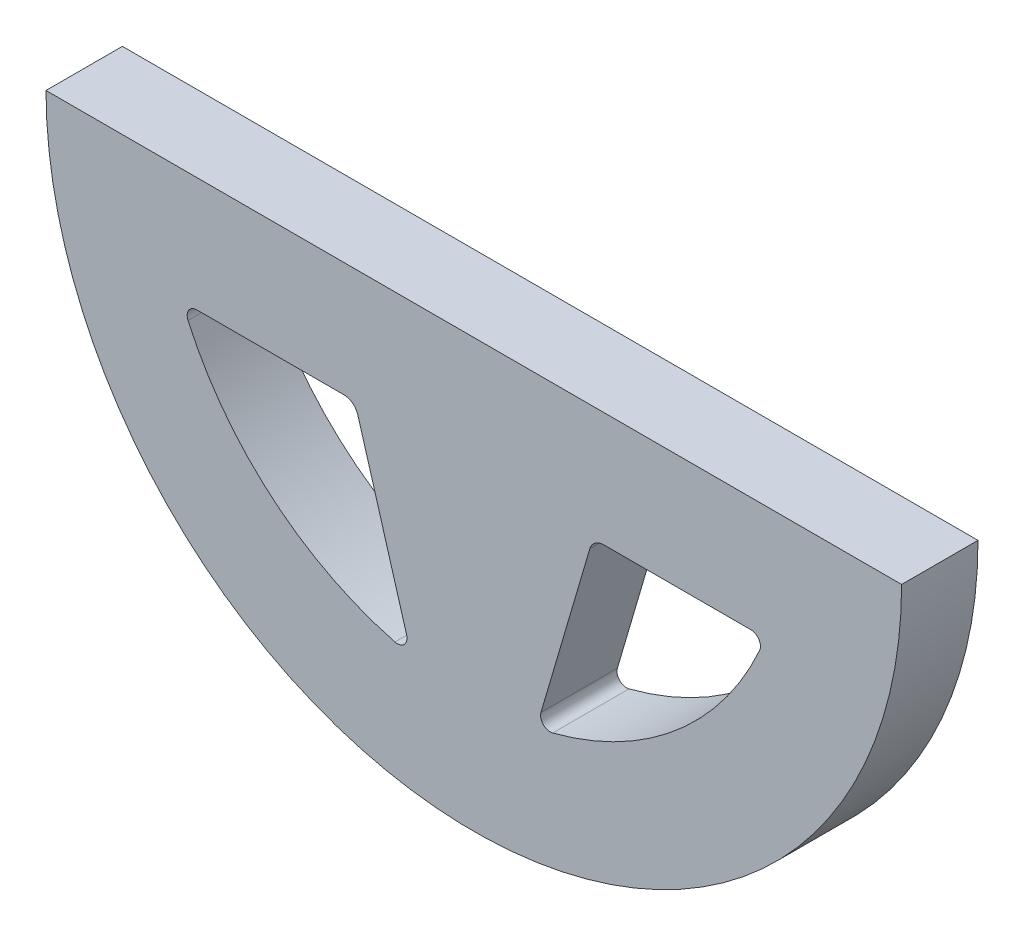
ISO-10303-21;
HEADER;
FILE_DESCRIPTION(('STEP AP214'),'2;1');
FILE_NAME('part.step','',(''),(''),'','','');
FILE_SCHEMA(('AUTOMOTIVE_DESIGN { 1 0 10303 214 1 1 1 1 }'));
ENDSEC;
DATA;
#1=APPLICATION_CONTEXT('core data for automotive mechanical design processes');
#2=APPLICATION_PROTOCOL_DEFINITION('international standard','automotive_design',2000,#1);
#3=PRODUCT_CONTEXT('',#1,'mechanical');
#4=PRODUCT('Part','Part','',(#3));
#5=PRODUCT_RELATED_PRODUCT_CATEGORY('part','',(#4));
#6=PRODUCT_DEFINITION_FORMATION('','',#4);
#7=PRODUCT_DEFINITION_CONTEXT('part definition',#1,'design');
#8=PRODUCT_DEFINITION('design','',#6,#7);
#9=PRODUCT_DEFINITION_SHAPE('','',#8);
#10=(LENGTH_UNIT() NAMED_UNIT(*) SI_UNIT(.MILLI.,.METRE.));
#11=(NAMED_UNIT(*) PLANE_ANGLE_UNIT() SI_UNIT($,.RADIAN.));
#12=(NAMED_UNIT(*) SI_UNIT($,.STERADIAN.) SOLID_ANGLE_UNIT());
#13=UNCERTAINTY_MEASURE_WITH_UNIT(LENGTH_MEASURE(1.E-05),#10,'distance_accuracy_value','');
#14=(GEOMETRIC_REPRESENTATION_CONTEXT(3) GLOBAL_UNCERTAINTY_ASSIGNED_CONTEXT((#13)) GLOBAL_UNIT_ASSIGNED_CONTEXT((#10,
#11,#12)) REPRESENTATION_CONTEXT('',''));
#15=CARTESIAN_POINT('',(0.,0.,0.));
#16=DIRECTION('',(0.,0.,1.));
#17=DIRECTION('',(1.,0.,0.));
#18=AXIS2_PLACEMENT_3D('',#15,#16,#17);
#19=CARTESIAN_POINT('',(-3.175,0.,3.175));
#20=DIRECTION('',(0.,0.,1.));
#21=DIRECTION('',(1.,0.,0.));
#22=AXIS2_PLACEMENT_3D('',#19,#20,#21);
#23=PLANE('',#22);
#24=CARTESIAN_POINT('',(-3.175,0.,3.175));
#25=DIRECTION('',(0.,0.,1.));
#26=DIRECTION('',(1.,0.,0.));
#27=AXIS2_PLACEMENT_3D('',#24,#25,#26);
#28=CIRCLE('',#27,17.78);
#29=CARTESIAN_POINT('',(-20.955,0.,3.175));
#30=VERTEX_POINT('',#29);
#31=CARTESIAN_POINT('',(14.605,0.,3.175));
#32=VERTEX_POINT('',#31);
#33=EDGE_CURVE('E142',#30,#32,#28,.T.);
#34=ORIENTED_EDGE('',*,*,#33,.T.);
#35=DIRECTION('',(-1.,0.,0.));
#36=VECTOR('',#35,1.);
#37=CARTESIAN_POINT('',(-20.955,0.,3.175));
#38=LINE('',#37,#36);
#39=EDGE_CURVE('E132',#32,#30,#38,.T.);
#40=ORIENTED_EDGE('',*,*,#39,.T.);
#41=EDGE_LOOP('',(#34,#40));
#42=FACE_BOUND('',#41,.T.);
#43=DIRECTION('',(-0.28216632399155,0.959365501571271,0.));
#44=VECTOR('',#43,1.);
#45=CARTESIAN_POINT('',(-8.12426470588235,-4.7625,3.175));
#46=LINE('',#45,#44);
#47=CARTESIAN_POINT('',(-5.96660593493,-12.098539821238,3.175));
#48=VERTEX_POINT('',#47);
#49=CARTESIAN_POINT('',(-7.99758817482204,-5.19320020560507,3.175));
#50=VERTEX_POINT('',#49);
#51=EDGE_CURVE('E243',#48,#50,#46,.T.);
#52=ORIENTED_EDGE('',*,*,#51,.F.);
#53=CARTESIAN_POINT('',(-6.35035213555851,-12.2114063508346,3.175));
#54=DIRECTION('',(0.,0.,1.));
#55=DIRECTION('',(1.,0.,0.));
#56=AXIS2_PLACEMENT_3D('',#53,#54,#55);
#57=CIRCLE('',#56,0.4);
#58=CARTESIAN_POINT('',(-6.45101715273492,-12.598532369486,3.175));
#59=VERTEX_POINT('',#58);
#60=EDGE_CURVE('E186',#48,#59,#57,.F.);
#61=ORIENTED_EDGE('',*,*,#60,.T.);
#62=CARTESIAN_POINT('',(-3.175,0.,3.175));
#63=DIRECTION('',(0.,0.,1.));
#64=DIRECTION('',(1.,0.,0.));
#65=AXIS2_PLACEMENT_3D('',#62,#63,#64);
#66=CIRCLE('',#65,13.0175);
#67=CARTESIAN_POINT('',(-15.0530178927975,-5.32616158113731,3.175));
#68=VERTEX_POINT('',#67);
#69=EDGE_CURVE('E240',#68,#59,#66,.T.);
#70=ORIENTED_EDGE('',*,*,#69,.F.);
#71=CARTESIAN_POINT('',(-14.6880317466773,-5.1625,3.175));
#72=DIRECTION('',(0.,0.,1.));
#73=DIRECTION('',(1.,0.,0.));
#74=AXIS2_PLACEMENT_3D('',#71,#72,#73);
#75=CIRCLE('',#74,0.4);
#76=CARTESIAN_POINT('',(-14.6880317466773,-4.7625,3.175));
#77=VERTEX_POINT('',#76);
#78=EDGE_CURVE('E190',#68,#77,#75,.F.);
#79=ORIENTED_EDGE('',*,*,#78,.T.);
#80=DIRECTION('',(-1.,0.,0.));
#81=VECTOR('',#80,1.);
#82=CARTESIAN_POINT('',(-15.2900278579952,-4.7625,3.175));
#83=LINE('',#82,#81);
#84=CARTESIAN_POINT('',(-8.5732074757648,-4.7625,3.175));
#85=VERTEX_POINT('',#84);
#86=EDGE_CURVE('E247',#85,#77,#83,.T.);
#87=ORIENTED_EDGE('',*,*,#86,.F.);
#88=CARTESIAN_POINT('',(-8.5732074757648,-5.3625,3.175));
#89=DIRECTION('',(0.,0.,1.));
#90=DIRECTION('',(1.,0.,0.));
#91=AXIS2_PLACEMENT_3D('',#88,#89,#90);
#92=CIRCLE('',#91,0.6);
#93=EDGE_CURVE('E11',#85,#50,#92,.F.);
#94=ORIENTED_EDGE('',*,*,#93,.T.);
#95=EDGE_LOOP('',(#52,#61,#70,#79,#87,#94));
#96=FACE_BOUND('',#95,.T.);
#97=DIRECTION('',(-1.,0.,0.));
#98=VECTOR('',#97,1.);
#99=CARTESIAN_POINT('',(1.77426470588235,-4.7625,3.175));
#100=LINE('',#99,#98);
#101=CARTESIAN_POINT('',(8.33803174667733,-4.7625,3.175));
#102=VERTEX_POINT('',#101);
#103=CARTESIAN_POINT('',(2.2232074757648,-4.7625,3.175));
#104=VERTEX_POINT('',#103);
#105=EDGE_CURVE('E210',#102,#104,#100,.T.);
#106=ORIENTED_EDGE('',*,*,#105,.F.);
#107=CARTESIAN_POINT('',(8.33803174667733,-5.1625,3.175));
#108=DIRECTION('',(0.,0.,1.));
#109=DIRECTION('',(1.,0.,0.));
#110=AXIS2_PLACEMENT_3D('',#107,#108,#109);
#111=CIRCLE('',#110,0.4);
#112=CARTESIAN_POINT('',(8.70301789279747,-5.32616158113731,3.175));
#113=VERTEX_POINT('',#112);
#114=EDGE_CURVE('E177',#102,#113,#111,.F.);
#115=ORIENTED_EDGE('',*,*,#114,.T.);
#116=CARTESIAN_POINT('',(-3.175,0.,3.175));
#117=DIRECTION('',(0.,0.,1.));
#118=DIRECTION('',(1.,0.,0.));
#119=AXIS2_PLACEMENT_3D('',#116,#117,#118);
#120=CIRCLE('',#119,13.0175);
#121=CARTESIAN_POINT('',(0.101017152734926,-12.598532369486,3.175));
#122=VERTEX_POINT('',#121);
#123=EDGE_CURVE('E221',#122,#113,#120,.T.);
#124=ORIENTED_EDGE('',*,*,#123,.F.);
#125=CARTESIAN_POINT('',(0.000352135558510935,-12.2114063508346,3.175));
#126=DIRECTION('',(0.,0.,1.));
#127=DIRECTION('',(1.,0.,0.));
#128=AXIS2_PLACEMENT_3D('',#125,#126,#127);
#129=CIRCLE('',#128,0.4);
#130=CARTESIAN_POINT('',(-0.383394065069995,-12.098539821238,3.175));
#131=VERTEX_POINT('',#130);
#132=EDGE_CURVE('E181',#122,#131,#129,.F.);
#133=ORIENTED_EDGE('',*,*,#132,.T.);
#134=DIRECTION('',(-0.28216632399155,-0.959365501571271,0.));
#135=VECTOR('',#134,1.);
#136=CARTESIAN_POINT('',(1.77426470588235,-4.7625,3.175));
#137=LINE('',#136,#135);
#138=CARTESIAN_POINT('',(1.64758817482204,-5.19320020560507,3.175));
#139=VERTEX_POINT('',#138);
#140=EDGE_CURVE('E212',#139,#131,#137,.T.);
#141=ORIENTED_EDGE('',*,*,#140,.F.);
#142=CARTESIAN_POINT('',(2.2232074757648,-5.3625,3.175));
#143=DIRECTION('',(0.,0.,1.));
#144=DIRECTION('',(1.,0.,0.));
#145=AXIS2_PLACEMENT_3D('',#142,#143,#144);
#146=CIRCLE('',#145,0.6);
#147=EDGE_CURVE('E204',#139,#104,#146,.F.);
#148=ORIENTED_EDGE('',*,*,#147,.T.);
#149=EDGE_LOOP('',(#106,#115,#124,#133,#141,#148));
#150=FACE_BOUND('',#149,.T.);
#151=ADVANCED_FACE('F33',(#42,#96,#150),#23,.T.);
#152=CARTESIAN_POINT('',(-3.175,0.,0.));
#153=DIRECTION('',(0.,0.,1.));
#154=DIRECTION('',(1.,0.,0.));
#155=AXIS2_PLACEMENT_3D('',#152,#153,#154);
#156=PLANE('',#155);
#157=DIRECTION('',(-0.28216632399155,0.959365501571271,0.));
#158=VECTOR('',#157,1.);
#159=CARTESIAN_POINT('',(-8.12426470588235,-4.7625,0.));
#160=LINE('',#159,#158);
#161=CARTESIAN_POINT('',(-5.96660593493,-12.098539821238,0.));
#162=VERTEX_POINT('',#161);
#163=CARTESIAN_POINT('',(-7.99758817482204,-5.19320020560507,0.));
#164=VERTEX_POINT('',#163);
#165=EDGE_CURVE('E252',#162,#164,#160,.T.);
#166=ORIENTED_EDGE('',*,*,#165,.T.);
#167=CARTESIAN_POINT('',(-8.5732074757648,-5.3625,0.));
#168=DIRECTION('',(0.,0.,1.));
#169=DIRECTION('',(1.,0.,0.));
#170=AXIS2_PLACEMENT_3D('',#167,#168,#169);
#171=CIRCLE('',#170,0.6);
#172=CARTESIAN_POINT('',(-8.5732074757648,-4.7625,0.));
#173=VERTEX_POINT('',#172);
#174=EDGE_CURVE('E41',#164,#173,#171,.T.);
#175=ORIENTED_EDGE('',*,*,#174,.T.);
#176=DIRECTION('',(-1.,0.,0.));
#177=VECTOR('',#176,1.);
#178=CARTESIAN_POINT('',(-15.2900278579952,-4.7625,0.));
#179=LINE('',#178,#177);
#180=CARTESIAN_POINT('',(-14.6880317466773,-4.7625,0.));
#181=VERTEX_POINT('',#180);
#182=EDGE_CURVE('E244',#173,#181,#179,.T.);
#183=ORIENTED_EDGE('',*,*,#182,.T.);
#184=CARTESIAN_POINT('',(-14.6880317466773,-5.1625,0.));
#185=DIRECTION('',(0.,0.,1.));
#186=DIRECTION('',(1.,0.,0.));
#187=AXIS2_PLACEMENT_3D('',#184,#185,#186);
#188=CIRCLE('',#187,0.4);
#189=CARTESIAN_POINT('',(-15.0530178927975,-5.32616158113731,0.));
#190=VERTEX_POINT('',#189);
#191=EDGE_CURVE('E188',#181,#190,#188,.T.);
#192=ORIENTED_EDGE('',*,*,#191,.T.);
#193=CARTESIAN_POINT('',(-3.175,0.,0.));
#194=DIRECTION('',(0.,0.,1.));
#195=DIRECTION('',(1.,0.,0.));
#196=AXIS2_PLACEMENT_3D('',#193,#194,#195);
#197=CIRCLE('',#196,13.0175);
#198=CARTESIAN_POINT('',(-6.45101715273492,-12.598532369486,0.));
#199=VERTEX_POINT('',#198);
#200=EDGE_CURVE('E249',#190,#199,#197,.T.);
#201=ORIENTED_EDGE('',*,*,#200,.T.);
#202=CARTESIAN_POINT('',(-6.35035213555851,-12.2114063508346,0.));
#203=DIRECTION('',(0.,0.,1.));
#204=DIRECTION('',(1.,0.,0.));
#205=AXIS2_PLACEMENT_3D('',#202,#203,#204);
#206=CIRCLE('',#205,0.4);
#207=EDGE_CURVE('E184',#199,#162,#206,.T.);
#208=ORIENTED_EDGE('',*,*,#207,.T.);
#209=EDGE_LOOP('',(#166,#175,#183,#192,#201,#208));
#210=FACE_BOUND('',#209,.T.);
#211=CARTESIAN_POINT('',(-3.175,0.,0.));
#212=DIRECTION('',(0.,0.,1.));
#213=DIRECTION('',(1.,0.,0.));
#214=AXIS2_PLACEMENT_3D('',#211,#212,#213);
#215=CIRCLE('',#214,17.78);
#216=CARTESIAN_POINT('',(-20.955,0.,0.));
#217=VERTEX_POINT('',#216);
#218=CARTESIAN_POINT('',(14.605,0.,0.));
#219=VERTEX_POINT('',#218);
#220=EDGE_CURVE('E150',#217,#219,#215,.T.);
#221=ORIENTED_EDGE('',*,*,#220,.F.);
#222=DIRECTION('',(-1.,0.,0.));
#223=VECTOR('',#222,1.);
#224=CARTESIAN_POINT('',(-20.955,0.,0.));
#225=LINE('',#224,#223);
#226=EDGE_CURVE('E146',#219,#217,#225,.T.);
#227=ORIENTED_EDGE('',*,*,#226,.F.);
#228=EDGE_LOOP('',(#221,#227));
#229=FACE_BOUND('',#228,.T.);
#230=DIRECTION('',(-1.,0.,0.));
#231=VECTOR('',#230,1.);
#232=CARTESIAN_POINT('',(1.77426470588235,-4.7625,0.));
#233=LINE('',#232,#231);
#234=CARTESIAN_POINT('',(8.33803174667733,-4.7625,0.));
#235=VERTEX_POINT('',#234);
#236=CARTESIAN_POINT('',(2.2232074757648,-4.7625,0.));
#237=VERTEX_POINT('',#236);
#238=EDGE_CURVE('E229',#235,#237,#233,.T.);
#239=ORIENTED_EDGE('',*,*,#238,.T.);
#240=CARTESIAN_POINT('',(2.2232074757648,-5.3625,0.));
#241=DIRECTION('',(0.,0.,1.));
#242=DIRECTION('',(1.,0.,0.));
#243=AXIS2_PLACEMENT_3D('',#240,#241,#242);
#244=CIRCLE('',#243,0.6);
#245=CARTESIAN_POINT('',(1.64758817482204,-5.19320020560507,0.));
#246=VERTEX_POINT('',#245);
#247=EDGE_CURVE('E202',#237,#246,#244,.T.);
#248=ORIENTED_EDGE('',*,*,#247,.T.);
#249=DIRECTION('',(-0.28216632399155,-0.959365501571271,0.));
#250=VECTOR('',#249,1.);
#251=CARTESIAN_POINT('',(1.77426470588235,-4.7625,0.));
#252=LINE('',#251,#250);
#253=CARTESIAN_POINT('',(-0.383394065069995,-12.098539821238,0.));
#254=VERTEX_POINT('',#253);
#255=EDGE_CURVE('E227',#246,#254,#252,.T.);
#256=ORIENTED_EDGE('',*,*,#255,.T.);
#257=CARTESIAN_POINT('',(0.000352135558510935,-12.2114063508346,0.));
#258=DIRECTION('',(0.,0.,1.));
#259=DIRECTION('',(1.,0.,0.));
#260=AXIS2_PLACEMENT_3D('',#257,#258,#259);
#261=CIRCLE('',#260,0.4);
#262=CARTESIAN_POINT('',(0.101017152734926,-12.598532369486,0.));
#263=VERTEX_POINT('',#262);
#264=EDGE_CURVE('E179',#254,#263,#261,.T.);
#265=ORIENTED_EDGE('',*,*,#264,.T.);
#266=CARTESIAN_POINT('',(-3.175,0.,0.));
#267=DIRECTION('',(0.,0.,1.));
#268=DIRECTION('',(1.,0.,0.));
#269=AXIS2_PLACEMENT_3D('',#266,#267,#268);
#270=CIRCLE('',#269,13.0175);
#271=CARTESIAN_POINT('',(8.70301789279747,-5.32616158113731,0.));
#272=VERTEX_POINT('',#271);
#273=EDGE_CURVE('E236',#263,#272,#270,.T.);
#274=ORIENTED_EDGE('',*,*,#273,.T.);
#275=CARTESIAN_POINT('',(8.33803174667733,-5.1625,0.));
#276=DIRECTION('',(0.,0.,1.));
#277=DIRECTION('',(1.,0.,0.));
#278=AXIS2_PLACEMENT_3D('',#275,#276,#277);
#279=CIRCLE('',#278,0.4);
#280=EDGE_CURVE('E175',#272,#235,#279,.T.);
#281=ORIENTED_EDGE('',*,*,#280,.T.);
#282=EDGE_LOOP('',(#239,#248,#256,#265,#274,#281));
#283=FACE_BOUND('',#282,.T.);
#284=ADVANCED_FACE('F226',(#210,#229,#283),#156,.F.);
#285=CARTESIAN_POINT('',(-3.175,0.,3.175));
#286=DIRECTION('',(0.,0.,-1.));
#287=DIRECTION('',(-1.,0.,0.));
#288=AXIS2_PLACEMENT_3D('',#285,#286,#287);
#289=CYLINDRICAL_SURFACE('',#288,17.78);
#290=ORIENTED_EDGE('',*,*,#220,.T.);
#291=DIRECTION('',(0.,0.,-1.));
#292=VECTOR('',#291,1.);
#293=CARTESIAN_POINT('',(14.605,0.,3.175));
#294=LINE('',#293,#292);
#295=EDGE_CURVE('E136',#32,#219,#294,.T.);
#296=ORIENTED_EDGE('',*,*,#295,.F.);
#297=ORIENTED_EDGE('',*,*,#33,.F.);
#298=DIRECTION('',(0.,0.,-1.));
#299=VECTOR('',#298,1.);
#300=CARTESIAN_POINT('',(-20.955,0.,3.175));
#301=LINE('',#300,#299);
#302=EDGE_CURVE('E139',#30,#217,#301,.T.);
#303=ORIENTED_EDGE('',*,*,#302,.T.);
#304=EDGE_LOOP('',(#290,#296,#297,#303));
#305=FACE_BOUND('',#304,.T.);
#306=ADVANCED_FACE('F148',(#305),#289,.T.);
#307=CARTESIAN_POINT('',(-20.955,0.,3.175));
#308=DIRECTION('',(0.,-1.,0.));
#309=DIRECTION('',(0.,0.,-1.));
#310=AXIS2_PLACEMENT_3D('',#307,#308,#309);
#311=PLANE('',#310);
#312=ORIENTED_EDGE('',*,*,#226,.T.);
#313=ORIENTED_EDGE('',*,*,#302,.F.);
#314=ORIENTED_EDGE('',*,*,#39,.F.);
#315=ORIENTED_EDGE('',*,*,#295,.T.);
#316=EDGE_LOOP('',(#312,#313,#314,#315));
#317=FACE_BOUND('',#316,.T.);
#318=ADVANCED_FACE('F134',(#317),#311,.F.);
#319=CARTESIAN_POINT('',(-3.175,0.,3.175));
#320=DIRECTION('',(0.,0.,-1.));
#321=DIRECTION('',(-1.,0.,0.));
#322=AXIS2_PLACEMENT_3D('',#319,#320,#321);
#323=CYLINDRICAL_SURFACE('',#322,13.0175);
#324=ORIENTED_EDGE('',*,*,#69,.T.);
#325=DIRECTION('',(0.,0.,-1.));
#326=VECTOR('',#325,1.);
#327=CARTESIAN_POINT('',(-6.45101715273492,-12.598532369486,3.175));
#328=LINE('',#327,#326);
#329=EDGE_CURVE('E167',#59,#199,#328,.T.);
#330=ORIENTED_EDGE('',*,*,#329,.T.);
#331=ORIENTED_EDGE('',*,*,#200,.F.);
#332=DIRECTION('',(0.,0.,-1.));
#333=VECTOR('',#332,1.);
#334=CARTESIAN_POINT('',(-15.0530178927975,-5.32616158113731,3.175));
#335=LINE('',#334,#333);
#336=EDGE_CURVE('E165',#190,#68,#335,.F.);
#337=ORIENTED_EDGE('',*,*,#336,.T.);
#338=EDGE_LOOP('',(#324,#330,#331,#337));
#339=FACE_BOUND('',#338,.T.);
#340=ADVANCED_FACE('F267',(#339),#323,.F.);
#341=CARTESIAN_POINT('',(-8.12426470588235,-4.7625,3.175));
#342=DIRECTION('',(-0.959365501571271,-0.28216632399155,0.));
#343=DIRECTION('',(0.28216632399155,-0.959365501571271,0.));
#344=AXIS2_PLACEMENT_3D('',#341,#342,#343);
#345=PLANE('',#344);
#346=ORIENTED_EDGE('',*,*,#51,.T.);
#347=DIRECTION('',(0.,0.,-1.));
#348=VECTOR('',#347,1.);
#349=CARTESIAN_POINT('',(-7.99758817482204,-5.19320020560507,0.));
#350=LINE('',#349,#348);
#351=EDGE_CURVE('E198',#50,#164,#350,.T.);
#352=ORIENTED_EDGE('',*,*,#351,.T.);
#353=ORIENTED_EDGE('',*,*,#165,.F.);
#354=DIRECTION('',(0.,0.,1.));
#355=VECTOR('',#354,1.);
#356=CARTESIAN_POINT('',(-5.96660593493,-12.098539821238,3.175));
#357=LINE('',#356,#355);
#358=EDGE_CURVE('E170',#162,#48,#357,.T.);
#359=ORIENTED_EDGE('',*,*,#358,.T.);
#360=EDGE_LOOP('',(#346,#352,#353,#359));
#361=FACE_BOUND('',#360,.T.);
#362=ADVANCED_FACE('F296',(#361),#345,.T.);
#363=CARTESIAN_POINT('',(-15.2900278579952,-4.7625,3.175));
#364=DIRECTION('',(0.,-1.,0.));
#365=DIRECTION('',(1.,0.,0.));
#366=AXIS2_PLACEMENT_3D('',#363,#364,#365);
#367=PLANE('',#366);
#368=ORIENTED_EDGE('',*,*,#182,.F.);
#369=DIRECTION('',(0.,0.,-1.));
#370=VECTOR('',#369,1.);
#371=CARTESIAN_POINT('',(-8.5732074757648,-4.7625,3.175));
#372=LINE('',#371,#370);
#373=EDGE_CURVE('E54',#173,#85,#372,.F.);
#374=ORIENTED_EDGE('',*,*,#373,.T.);
#375=ORIENTED_EDGE('',*,*,#86,.T.);
#376=DIRECTION('',(0.,0.,1.));
#377=VECTOR('',#376,1.);
#378=CARTESIAN_POINT('',(-14.6880317466773,-4.7625,0.));
#379=LINE('',#378,#377);
#380=EDGE_CURVE('E172',#77,#181,#379,.F.);
#381=ORIENTED_EDGE('',*,*,#380,.T.);
#382=EDGE_LOOP('',(#368,#374,#375,#381));
#383=FACE_BOUND('',#382,.T.);
#384=ADVANCED_FACE('F307',(#383),#367,.T.);
#385=CARTESIAN_POINT('',(-3.175,0.,3.175));
#386=DIRECTION('',(0.,0.,-1.));
#387=DIRECTION('',(-1.,0.,0.));
#388=AXIS2_PLACEMENT_3D('',#385,#386,#387);
#389=CYLINDRICAL_SURFACE('',#388,13.0175);
#390=ORIENTED_EDGE('',*,*,#123,.T.);
#391=DIRECTION('',(0.,0.,-1.));
#392=VECTOR('',#391,1.);
#393=CARTESIAN_POINT('',(8.70301789279747,-5.32616158113731,3.175));
#394=LINE('',#393,#392);
#395=EDGE_CURVE('E153',#113,#272,#394,.T.);
#396=ORIENTED_EDGE('',*,*,#395,.T.);
#397=ORIENTED_EDGE('',*,*,#273,.F.);
#398=DIRECTION('',(0.,0.,-1.));
#399=VECTOR('',#398,1.);
#400=CARTESIAN_POINT('',(0.101017152734926,-12.598532369486,3.175));
#401=LINE('',#400,#399);
#402=EDGE_CURVE('E151',#263,#122,#401,.F.);
#403=ORIENTED_EDGE('',*,*,#402,.T.);
#404=EDGE_LOOP('',(#390,#396,#397,#403));
#405=FACE_BOUND('',#404,.T.);
#406=ADVANCED_FACE('F309',(#405),#389,.F.);
#407=CARTESIAN_POINT('',(1.77426470588235,-4.7625,3.175));
#408=DIRECTION('',(0.,-1.,0.));
#409=DIRECTION('',(0.,0.,-1.));
#410=AXIS2_PLACEMENT_3D('',#407,#408,#409);
#411=PLANE('',#410);
#412=ORIENTED_EDGE('',*,*,#105,.T.);
#413=DIRECTION('',(0.,0.,-1.));
#414=VECTOR('',#413,1.);
#415=CARTESIAN_POINT('',(2.2232074757648,-4.7625,0.));
#416=LINE('',#415,#414);
#417=EDGE_CURVE('E193',#104,#237,#416,.T.);
#418=ORIENTED_EDGE('',*,*,#417,.T.);
#419=ORIENTED_EDGE('',*,*,#238,.F.);
#420=DIRECTION('',(0.,0.,1.));
#421=VECTOR('',#420,1.);
#422=CARTESIAN_POINT('',(8.33803174667733,-4.7625,3.175));
#423=LINE('',#422,#421);
#424=EDGE_CURVE('E160',#235,#102,#423,.T.);
#425=ORIENTED_EDGE('',*,*,#424,.T.);
#426=EDGE_LOOP('',(#412,#418,#419,#425));
#427=FACE_BOUND('',#426,.T.);
#428=ADVANCED_FACE('F217',(#427),#411,.T.);
#429=CARTESIAN_POINT('',(1.77426470588235,-4.7625,3.175));
#430=DIRECTION('',(0.959365501571271,-0.28216632399155,0.));
#431=DIRECTION('',(0.28216632399155,0.959365501571271,0.));
#432=AXIS2_PLACEMENT_3D('',#429,#430,#431);
#433=PLANE('',#432);
#434=ORIENTED_EDGE('',*,*,#255,.F.);
#435=DIRECTION('',(0.,0.,-1.));
#436=VECTOR('',#435,1.);
#437=CARTESIAN_POINT('',(1.64758817482204,-5.19320020560507,3.175));
#438=LINE('',#437,#436);
#439=EDGE_CURVE('E196',#246,#139,#438,.F.);
#440=ORIENTED_EDGE('',*,*,#439,.T.);
#441=ORIENTED_EDGE('',*,*,#140,.T.);
#442=DIRECTION('',(0.,0.,1.));
#443=VECTOR('',#442,1.);
#444=CARTESIAN_POINT('',(-0.383394065069995,-12.098539821238,0.));
#445=LINE('',#444,#443);
#446=EDGE_CURVE('E162',#131,#254,#445,.F.);
#447=ORIENTED_EDGE('',*,*,#446,.T.);
#448=EDGE_LOOP('',(#434,#440,#441,#447));
#449=FACE_BOUND('',#448,.T.);
#450=ADVANCED_FACE('F231',(#449),#433,.T.);
#451=CARTESIAN_POINT('',(8.33803174667733,-5.1625,3.175));
#452=DIRECTION('',(0.,0.,-1.));
#453=DIRECTION('',(-1.,0.,0.));
#454=AXIS2_PLACEMENT_3D('',#451,#452,#453);
#455=CYLINDRICAL_SURFACE('',#454,0.4);
#456=ORIENTED_EDGE('',*,*,#114,.F.);
#457=ORIENTED_EDGE('',*,*,#424,.F.);
#458=ORIENTED_EDGE('',*,*,#280,.F.);
#459=ORIENTED_EDGE('',*,*,#395,.F.);
#460=EDGE_LOOP('',(#456,#457,#458,#459));
#461=FACE_BOUND('',#460,.T.);
#462=ADVANCED_FACE('F269',(#461),#455,.F.);
#463=CARTESIAN_POINT('',(0.000352135558510935,-12.2114063508346,3.175));
#464=DIRECTION('',(0.,0.,-1.));
#465=DIRECTION('',(-1.,0.,0.));
#466=AXIS2_PLACEMENT_3D('',#463,#464,#465);
#467=CYLINDRICAL_SURFACE('',#466,0.4);
#468=ORIENTED_EDGE('',*,*,#132,.F.);
#469=ORIENTED_EDGE('',*,*,#402,.F.);
#470=ORIENTED_EDGE('',*,*,#264,.F.);
#471=ORIENTED_EDGE('',*,*,#446,.F.);
#472=EDGE_LOOP('',(#468,#469,#470,#471));
#473=FACE_BOUND('',#472,.T.);
#474=ADVANCED_FACE('F272',(#473),#467,.F.);
#475=CARTESIAN_POINT('',(-6.35035213555851,-12.2114063508346,3.175));
#476=DIRECTION('',(0.,0.,-1.));
#477=DIRECTION('',(-1.,0.,0.));
#478=AXIS2_PLACEMENT_3D('',#475,#476,#477);
#479=CYLINDRICAL_SURFACE('',#478,0.4);
#480=ORIENTED_EDGE('',*,*,#60,.F.);
#481=ORIENTED_EDGE('',*,*,#358,.F.);
#482=ORIENTED_EDGE('',*,*,#207,.F.);
#483=ORIENTED_EDGE('',*,*,#329,.F.);
#484=EDGE_LOOP('',(#480,#481,#482,#483));
#485=FACE_BOUND('',#484,.T.);
#486=ADVANCED_FACE('F276',(#485),#479,.F.);
#487=CARTESIAN_POINT('',(-14.6880317466773,-5.1625,3.175));
#488=DIRECTION('',(0.,0.,-1.));
#489=DIRECTION('',(-1.,0.,0.));
#490=AXIS2_PLACEMENT_3D('',#487,#488,#489);
#491=CYLINDRICAL_SURFACE('',#490,0.4);
#492=ORIENTED_EDGE('',*,*,#78,.F.);
#493=ORIENTED_EDGE('',*,*,#336,.F.);
#494=ORIENTED_EDGE('',*,*,#191,.F.);
#495=ORIENTED_EDGE('',*,*,#380,.F.);
#496=EDGE_LOOP('',(#492,#493,#494,#495));
#497=FACE_BOUND('',#496,.T.);
#498=ADVANCED_FACE('F280',(#497),#491,.F.);
#499=CARTESIAN_POINT('',(2.2232074757648,-5.3625,3.175));
#500=DIRECTION('',(0.,0.,1.));
#501=DIRECTION('',(1.,0.,0.));
#502=AXIS2_PLACEMENT_3D('',#499,#500,#501);
#503=CYLINDRICAL_SURFACE('',#502,0.6);
#504=ORIENTED_EDGE('',*,*,#147,.F.);
#505=ORIENTED_EDGE('',*,*,#439,.F.);
#506=ORIENTED_EDGE('',*,*,#247,.F.);
#507=ORIENTED_EDGE('',*,*,#417,.F.);
#508=EDGE_LOOP('',(#504,#505,#506,#507));
#509=FACE_BOUND('',#508,.T.);
#510=ADVANCED_FACE('F223',(#509),#503,.F.);
#511=CARTESIAN_POINT('',(-8.5732074757648,-5.3625,3.175));
#512=DIRECTION('',(0.,0.,1.));
#513=DIRECTION('',(1.,0.,0.));
#514=AXIS2_PLACEMENT_3D('',#511,#512,#513);
#515=CYLINDRICAL_SURFACE('',#514,0.6);
#516=ORIENTED_EDGE('',*,*,#93,.F.);
#517=ORIENTED_EDGE('',*,*,#373,.F.);
#518=ORIENTED_EDGE('',*,*,#174,.F.);
#519=ORIENTED_EDGE('',*,*,#351,.F.);
#520=EDGE_LOOP('',(#516,#517,#518,#519));
#521=FACE_BOUND('',#520,.T.);
#522=ADVANCED_FACE('F35',(#521),#515,.F.);
#523=CLOSED_SHELL('',(#151,#284,#306,#318,#340,#362,#384,#406,#428,#450,#462,#474,#486,#498,
#510,#522));
#524=MANIFOLD_SOLID_BREP('B2',#523);
#525=ADVANCED_BREP_SHAPE_REPRESENTATION('',(#18,#524),#14);
#526=SHAPE_DEFINITION_REPRESENTATION(#9,#525);
ENDSEC;
END-ISO-10303-21;
